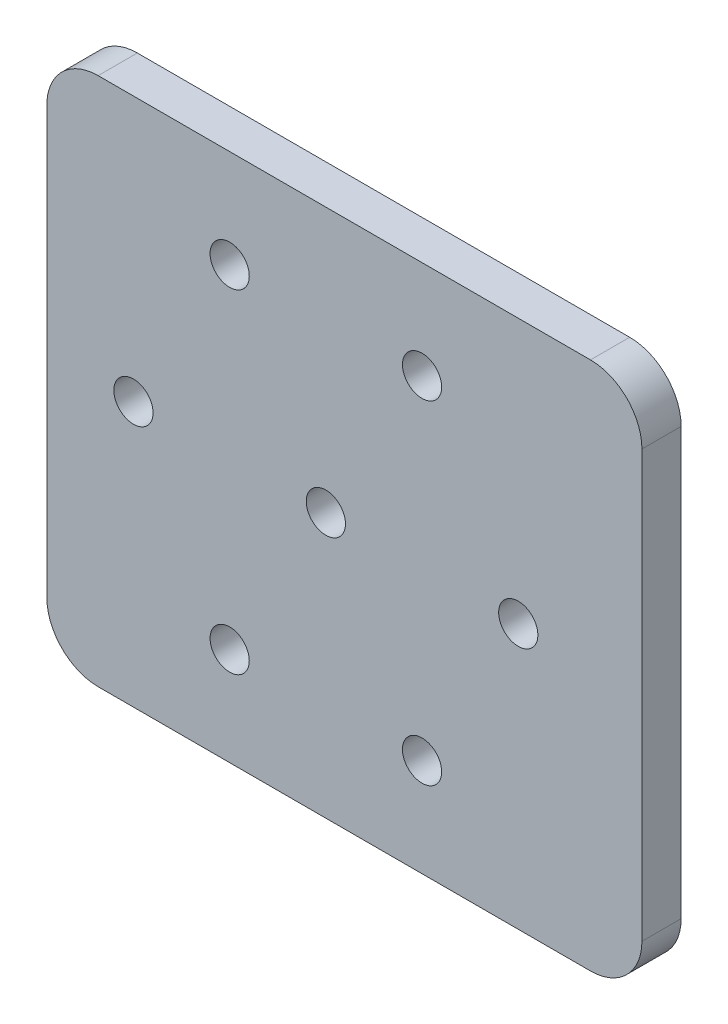
ISO-10303-21;
HEADER;
FILE_DESCRIPTION(('STEP AP214'),'2;1');
FILE_NAME('part.step','',(''),(''),'','','');
FILE_SCHEMA(('AUTOMOTIVE_DESIGN { 1 0 10303 214 1 1 1 1 }'));
ENDSEC;
DATA;
#1=APPLICATION_CONTEXT('core data for automotive mechanical design processes');
#2=APPLICATION_PROTOCOL_DEFINITION('international standard','automotive_design',2000,#1);
#3=PRODUCT_CONTEXT('',#1,'mechanical');
#4=PRODUCT('Part','Part','',(#3));
#5=PRODUCT_RELATED_PRODUCT_CATEGORY('part','',(#4));
#6=PRODUCT_DEFINITION_FORMATION('','',#4);
#7=PRODUCT_DEFINITION_CONTEXT('part definition',#1,'design');
#8=PRODUCT_DEFINITION('design','',#6,#7);
#9=PRODUCT_DEFINITION_SHAPE('','',#8);
#10=(LENGTH_UNIT() NAMED_UNIT(*) SI_UNIT(.MILLI.,.METRE.));
#11=(NAMED_UNIT(*) PLANE_ANGLE_UNIT() SI_UNIT($,.RADIAN.));
#12=(NAMED_UNIT(*) SI_UNIT($,.STERADIAN.) SOLID_ANGLE_UNIT());
#13=UNCERTAINTY_MEASURE_WITH_UNIT(LENGTH_MEASURE(1.E-05),#10,'distance_accuracy_value','');
#14=(GEOMETRIC_REPRESENTATION_CONTEXT(3) GLOBAL_UNCERTAINTY_ASSIGNED_CONTEXT((#13)) GLOBAL_UNIT_ASSIGNED_CONTEXT((#10,
#11,#12)) REPRESENTATION_CONTEXT('',''));
#15=CARTESIAN_POINT('',(0.,0.,0.));
#16=DIRECTION('',(0.,0.,1.));
#17=DIRECTION('',(1.,0.,0.));
#18=AXIS2_PLACEMENT_3D('',#15,#16,#17);
#19=CARTESIAN_POINT('',(-196.85,171.45,25.4));
#20=DIRECTION('',(0.,-1.,0.));
#21=DIRECTION('',(0.,0.,-1.));
#22=AXIS2_PLACEMENT_3D('',#19,#20,#21);
#23=PLANE('',#22);
#24=DIRECTION('',(0.,0.,1.));
#25=VECTOR('',#24,1.);
#26=CARTESIAN_POINT('',(-122.137381725075,171.45,0.));
#27=LINE('',#26,#25);
#28=CARTESIAN_POINT('',(-122.137381725075,171.45,0.));
#29=VERTEX_POINT('',#28);
#30=CARTESIAN_POINT('',(-122.137381725075,171.45,25.4));
#31=VERTEX_POINT('',#30);
#32=EDGE_CURVE('E127',#29,#31,#27,.T.);
#33=ORIENTED_EDGE('',*,*,#32,.T.);
#34=DIRECTION('',(-1.,0.,0.));
#35=VECTOR('',#34,1.);
#36=CARTESIAN_POINT('',(-196.85,171.45,25.4));
#37=LINE('',#36,#35);
#38=CARTESIAN_POINT('',(196.85,171.45,25.4));
#39=VERTEX_POINT('',#38);
#40=EDGE_CURVE('E135',#39,#31,#37,.T.);
#41=ORIENTED_EDGE('',*,*,#40,.F.);
#42=DIRECTION('',(0.,0.,-1.));
#43=VECTOR('',#42,1.);
#44=CARTESIAN_POINT('',(196.85,171.45,25.4));
#45=LINE('',#44,#43);
#46=CARTESIAN_POINT('',(196.85,171.45,0.));
#47=VERTEX_POINT('',#46);
#48=EDGE_CURVE('E143',#39,#47,#45,.T.);
#49=ORIENTED_EDGE('',*,*,#48,.T.);
#50=DIRECTION('',(-1.,0.,0.));
#51=VECTOR('',#50,1.);
#52=CARTESIAN_POINT('',(-196.85,171.45,0.));
#53=LINE('',#52,#51);
#54=EDGE_CURVE('E140',#47,#29,#53,.T.);
#55=ORIENTED_EDGE('',*,*,#54,.T.);
#56=EDGE_LOOP('',(#33,#41,#49,#55));
#57=FACE_BOUND('',#56,.T.);
#58=ADVANCED_FACE('F35',(#57),#23,.F.);
#59=CARTESIAN_POINT('',(-196.85,-171.45,25.4));
#60=DIRECTION('',(0.,1.,0.));
#61=DIRECTION('',(0.,0.,1.));
#62=AXIS2_PLACEMENT_3D('',#59,#60,#61);
#63=PLANE('',#62);
#64=DIRECTION('',(1.,0.,0.));
#65=VECTOR('',#64,1.);
#66=CARTESIAN_POINT('',(-196.85,-171.45,25.4));
#67=LINE('',#66,#65);
#68=CARTESIAN_POINT('',(-122.025168102681,-171.45,25.4));
#69=VERTEX_POINT('',#68);
#70=CARTESIAN_POINT('',(196.85,-171.45,25.4));
#71=VERTEX_POINT('',#70);
#72=EDGE_CURVE('E87',#69,#71,#67,.T.);
#73=ORIENTED_EDGE('',*,*,#72,.F.);
#74=DIRECTION('',(0.,0.,1.));
#75=VECTOR('',#74,1.);
#76=CARTESIAN_POINT('',(-122.025168102681,-171.45,0.));
#77=LINE('',#76,#75);
#78=CARTESIAN_POINT('',(-122.025168102681,-171.45,0.));
#79=VERTEX_POINT('',#78);
#80=EDGE_CURVE('E113',#79,#69,#77,.T.);
#81=ORIENTED_EDGE('',*,*,#80,.F.);
#82=DIRECTION('',(1.,0.,0.));
#83=VECTOR('',#82,1.);
#84=CARTESIAN_POINT('',(-196.85,-171.45,0.));
#85=LINE('',#84,#83);
#86=CARTESIAN_POINT('',(196.85,-171.45,0.));
#87=VERTEX_POINT('',#86);
#88=EDGE_CURVE('E120',#79,#87,#85,.T.);
#89=ORIENTED_EDGE('',*,*,#88,.T.);
#90=DIRECTION('',(0.,0.,-1.));
#91=VECTOR('',#90,1.);
#92=CARTESIAN_POINT('',(196.85,-171.45,25.4));
#93=LINE('',#92,#91);
#94=EDGE_CURVE('E11',#71,#87,#93,.T.);
#95=ORIENTED_EDGE('',*,*,#94,.F.);
#96=EDGE_LOOP('',(#73,#81,#89,#95));
#97=FACE_BOUND('',#96,.T.);
#98=ADVANCED_FACE('F37',(#97),#63,.F.);
#99=CARTESIAN_POINT('',(196.85,-138.1125,25.4));
#100=DIRECTION('',(0.,0.,-1.));
#101=DIRECTION('',(-1.,0.,0.));
#102=AXIS2_PLACEMENT_3D('',#99,#100,#101);
#103=CYLINDRICAL_SURFACE('',#102,33.3375);
#104=CARTESIAN_POINT('',(196.85,-138.1125,0.));
#105=DIRECTION('',(0.,0.,1.));
#106=DIRECTION('',(1.,0.,0.));
#107=AXIS2_PLACEMENT_3D('',#104,#105,#106);
#108=CIRCLE('',#107,33.3375);
#109=CARTESIAN_POINT('',(230.1875,-138.1125,0.));
#110=VERTEX_POINT('',#109);
#111=EDGE_CURVE('E126',#87,#110,#108,.T.);
#112=ORIENTED_EDGE('',*,*,#111,.T.);
#113=DIRECTION('',(0.,0.,-1.));
#114=VECTOR('',#113,1.);
#115=CARTESIAN_POINT('',(230.1875,-138.1125,25.4));
#116=LINE('',#115,#114);
#117=CARTESIAN_POINT('',(230.1875,-138.1125,25.4));
#118=VERTEX_POINT('',#117);
#119=EDGE_CURVE('E43',#118,#110,#116,.T.);
#120=ORIENTED_EDGE('',*,*,#119,.F.);
#121=CARTESIAN_POINT('',(196.85,-138.1125,25.4));
#122=DIRECTION('',(0.,0.,1.));
#123=DIRECTION('',(1.,0.,0.));
#124=AXIS2_PLACEMENT_3D('',#121,#122,#123);
#125=CIRCLE('',#124,33.3375);
#126=EDGE_CURVE('E161',#71,#118,#125,.T.);
#127=ORIENTED_EDGE('',*,*,#126,.F.);
#128=ORIENTED_EDGE('',*,*,#94,.T.);
#129=EDGE_LOOP('',(#112,#120,#127,#128));
#130=FACE_BOUND('',#129,.T.);
#131=ADVANCED_FACE('F255',(#130),#103,.T.);
#132=CARTESIAN_POINT('',(230.1875,-138.1125,25.4));
#133=DIRECTION('',(-1.,0.,0.));
#134=DIRECTION('',(0.,0.,1.));
#135=AXIS2_PLACEMENT_3D('',#132,#133,#134);
#136=PLANE('',#135);
#137=DIRECTION('',(0.,1.,0.));
#138=VECTOR('',#137,1.);
#139=CARTESIAN_POINT('',(230.1875,-138.1125,0.));
#140=LINE('',#139,#138);
#141=CARTESIAN_POINT('',(230.1875,138.1125,0.));
#142=VERTEX_POINT('',#141);
#143=EDGE_CURVE('E129',#110,#142,#140,.T.);
#144=ORIENTED_EDGE('',*,*,#143,.T.);
#145=DIRECTION('',(0.,0.,-1.));
#146=VECTOR('',#145,1.);
#147=CARTESIAN_POINT('',(230.1875,138.1125,25.4));
#148=LINE('',#147,#146);
#149=CARTESIAN_POINT('',(230.1875,138.1125,25.4));
#150=VERTEX_POINT('',#149);
#151=EDGE_CURVE('E145',#150,#142,#148,.T.);
#152=ORIENTED_EDGE('',*,*,#151,.F.);
#153=DIRECTION('',(0.,1.,0.));
#154=VECTOR('',#153,1.);
#155=CARTESIAN_POINT('',(230.1875,-138.1125,25.4));
#156=LINE('',#155,#154);
#157=EDGE_CURVE('E152',#118,#150,#156,.T.);
#158=ORIENTED_EDGE('',*,*,#157,.F.);
#159=ORIENTED_EDGE('',*,*,#119,.T.);
#160=EDGE_LOOP('',(#144,#152,#158,#159));
#161=FACE_BOUND('',#160,.T.);
#162=ADVANCED_FACE('F150',(#161),#136,.F.);
#163=CARTESIAN_POINT('',(196.85,138.1125,25.4));
#164=DIRECTION('',(0.,0.,-1.));
#165=DIRECTION('',(-1.,0.,0.));
#166=AXIS2_PLACEMENT_3D('',#163,#164,#165);
#167=CYLINDRICAL_SURFACE('',#166,33.3375);
#168=CARTESIAN_POINT('',(196.85,138.1125,0.));
#169=DIRECTION('',(0.,0.,1.));
#170=DIRECTION('',(1.,0.,0.));
#171=AXIS2_PLACEMENT_3D('',#168,#169,#170);
#172=CIRCLE('',#171,33.3375);
#173=EDGE_CURVE('E80',#142,#47,#172,.T.);
#174=ORIENTED_EDGE('',*,*,#173,.T.);
#175=ORIENTED_EDGE('',*,*,#48,.F.);
#176=CARTESIAN_POINT('',(196.85,138.1125,25.4));
#177=DIRECTION('',(0.,0.,1.));
#178=DIRECTION('',(1.,0.,0.));
#179=AXIS2_PLACEMENT_3D('',#176,#177,#178);
#180=CIRCLE('',#179,33.3375);
#181=EDGE_CURVE('E59',#150,#39,#180,.T.);
#182=ORIENTED_EDGE('',*,*,#181,.F.);
#183=ORIENTED_EDGE('',*,*,#151,.T.);
#184=EDGE_LOOP('',(#174,#175,#182,#183));
#185=FACE_BOUND('',#184,.T.);
#186=ADVANCED_FACE('F160',(#185),#167,.T.);
#187=CARTESIAN_POINT('',(-196.85,-138.1125,25.4));
#188=DIRECTION('',(0.,0.,1.));
#189=DIRECTION('',(1.,0.,0.));
#190=AXIS2_PLACEMENT_3D('',#187,#188,#189);
#191=PLANE('',#190);
#192=CARTESIAN_POINT('',(-36.9249615590201,107.95,25.4));
#193=DIRECTION('',(0.,0.,1.));
#194=DIRECTION('',(1.,0.,0.));
#195=AXIS2_PLACEMENT_3D('',#192,#193,#194);
#196=CIRCLE('',#195,12.7);
#197=CARTESIAN_POINT('',(-24.2249615590201,107.95,25.4));
#198=VERTEX_POINT('',#197);
#199=EDGE_CURVE('E215',#198,#198,#196,.T.);
#200=ORIENTED_EDGE('',*,*,#199,.F.);
#201=EDGE_LOOP('',(#200));
#202=FACE_BOUND('',#201,.T.);
#203=CARTESIAN_POINT('',(87.7249615590201,107.95,25.4));
#204=DIRECTION('',(0.,0.,1.));
#205=DIRECTION('',(1.,0.,0.));
#206=AXIS2_PLACEMENT_3D('',#203,#204,#205);
#207=CIRCLE('',#206,12.7);
#208=CARTESIAN_POINT('',(100.42496155902,107.95,25.4));
#209=VERTEX_POINT('',#208);
#210=EDGE_CURVE('E209',#209,#209,#207,.T.);
#211=ORIENTED_EDGE('',*,*,#210,.F.);
#212=EDGE_LOOP('',(#211));
#213=FACE_BOUND('',#212,.T.);
#214=CARTESIAN_POINT('',(150.04992311804,0.,25.4));
#215=DIRECTION('',(0.,0.,1.));
#216=DIRECTION('',(1.,0.,0.));
#217=AXIS2_PLACEMENT_3D('',#214,#215,#216);
#218=CIRCLE('',#217,12.7);
#219=CARTESIAN_POINT('',(162.74992311804,0.,25.4));
#220=VERTEX_POINT('',#219);
#221=EDGE_CURVE('E203',#220,#220,#218,.T.);
#222=ORIENTED_EDGE('',*,*,#221,.F.);
#223=EDGE_LOOP('',(#222));
#224=FACE_BOUND('',#223,.T.);
#225=CARTESIAN_POINT('',(87.7249615590201,-107.95,25.4));
#226=DIRECTION('',(0.,0.,1.));
#227=DIRECTION('',(1.,0.,0.));
#228=AXIS2_PLACEMENT_3D('',#225,#226,#227);
#229=CIRCLE('',#228,12.7);
#230=CARTESIAN_POINT('',(100.42496155902,-107.95,25.4));
#231=VERTEX_POINT('',#230);
#232=EDGE_CURVE('E197',#231,#231,#229,.T.);
#233=ORIENTED_EDGE('',*,*,#232,.F.);
#234=EDGE_LOOP('',(#233));
#235=FACE_BOUND('',#234,.T.);
#236=CARTESIAN_POINT('',(-36.9249615590201,-107.95,25.4));
#237=DIRECTION('',(0.,0.,1.));
#238=DIRECTION('',(1.,0.,0.));
#239=AXIS2_PLACEMENT_3D('',#236,#237,#238);
#240=CIRCLE('',#239,12.7);
#241=CARTESIAN_POINT('',(-24.2249615590201,-107.95,25.4));
#242=VERTEX_POINT('',#241);
#243=EDGE_CURVE('E191',#242,#242,#240,.T.);
#244=ORIENTED_EDGE('',*,*,#243,.F.);
#245=EDGE_LOOP('',(#244));
#246=FACE_BOUND('',#245,.T.);
#247=CARTESIAN_POINT('',(-99.2499231180402,0.,25.4));
#248=DIRECTION('',(0.,0.,1.));
#249=DIRECTION('',(1.,0.,0.));
#250=AXIS2_PLACEMENT_3D('',#247,#248,#249);
#251=CIRCLE('',#250,12.7);
#252=CARTESIAN_POINT('',(-86.5499231180402,0.,25.4));
#253=VERTEX_POINT('',#252);
#254=EDGE_CURVE('E185',#253,#253,#251,.T.);
#255=ORIENTED_EDGE('',*,*,#254,.F.);
#256=EDGE_LOOP('',(#255));
#257=FACE_BOUND('',#256,.T.);
#258=CARTESIAN_POINT('',(25.4,0.,25.4));
#259=DIRECTION('',(0.,0.,1.));
#260=DIRECTION('',(1.,0.,0.));
#261=AXIS2_PLACEMENT_3D('',#258,#259,#260);
#262=CIRCLE('',#261,12.7);
#263=CARTESIAN_POINT('',(38.1,0.,25.4));
#264=VERTEX_POINT('',#263);
#265=EDGE_CURVE('E179',#264,#264,#262,.T.);
#266=ORIENTED_EDGE('',*,*,#265,.F.);
#267=EDGE_LOOP('',(#266));
#268=FACE_BOUND('',#267,.T.);
#269=CARTESIAN_POINT('',(-122.137381725075,138.176,25.4));
#270=DIRECTION('',(0.,0.,-1.));
#271=DIRECTION('',(1.,0.,0.));
#272=AXIS2_PLACEMENT_3D('',#269,#270,#271);
#273=CIRCLE('',#272,33.274);
#274=CARTESIAN_POINT('',(-155.362668102681,139.975839194492,25.4));
#275=VERTEX_POINT('',#274);
#276=EDGE_CURVE('E117',#275,#31,#273,.T.);
#277=ORIENTED_EDGE('',*,*,#276,.F.);
#278=DIRECTION('',(0.,1.,0.));
#279=VECTOR('',#278,1.);
#280=CARTESIAN_POINT('',(-155.362668102681,139.975839194492,25.4));
#281=LINE('',#280,#279);
#282=CARTESIAN_POINT('',(-155.362668102681,-138.1125,25.4));
#283=VERTEX_POINT('',#282);
#284=EDGE_CURVE('E169',#283,#275,#281,.T.);
#285=ORIENTED_EDGE('',*,*,#284,.F.);
#286=CARTESIAN_POINT('',(-122.025168102681,-138.1125,25.4));
#287=DIRECTION('',(0.,0.,-1.));
#288=DIRECTION('',(1.,0.,0.));
#289=AXIS2_PLACEMENT_3D('',#286,#287,#288);
#290=CIRCLE('',#289,33.3375);
#291=EDGE_CURVE('E172',#69,#283,#290,.T.);
#292=ORIENTED_EDGE('',*,*,#291,.F.);
#293=ORIENTED_EDGE('',*,*,#72,.T.);
#294=ORIENTED_EDGE('',*,*,#126,.T.);
#295=ORIENTED_EDGE('',*,*,#157,.T.);
#296=ORIENTED_EDGE('',*,*,#181,.T.);
#297=ORIENTED_EDGE('',*,*,#40,.T.);
#298=EDGE_LOOP('',(#277,#285,#292,#293,#294,#295,#296,#297));
#299=FACE_BOUND('',#298,.T.);
#300=ADVANCED_FACE('F221',(#202,#213,#224,#235,#246,#257,#268,#299),#191,.T.);
#301=CARTESIAN_POINT('',(-196.85,-138.1125,0.));
#302=DIRECTION('',(0.,0.,1.));
#303=DIRECTION('',(1.,0.,0.));
#304=AXIS2_PLACEMENT_3D('',#301,#302,#303);
#305=PLANE('',#304);
#306=CARTESIAN_POINT('',(-36.9249615590201,107.95,0.));
#307=DIRECTION('',(0.,0.,1.));
#308=DIRECTION('',(1.,0.,0.));
#309=AXIS2_PLACEMENT_3D('',#306,#307,#308);
#310=CIRCLE('',#309,12.7);
#311=CARTESIAN_POINT('',(-24.2249615590201,107.95,0.));
#312=VERTEX_POINT('',#311);
#313=EDGE_CURVE('E212',#312,#312,#310,.T.);
#314=ORIENTED_EDGE('',*,*,#313,.T.);
#315=EDGE_LOOP('',(#314));
#316=FACE_BOUND('',#315,.T.);
#317=CARTESIAN_POINT('',(87.7249615590201,107.95,0.));
#318=DIRECTION('',(0.,0.,1.));
#319=DIRECTION('',(1.,0.,0.));
#320=AXIS2_PLACEMENT_3D('',#317,#318,#319);
#321=CIRCLE('',#320,12.7);
#322=CARTESIAN_POINT('',(100.42496155902,107.95,0.));
#323=VERTEX_POINT('',#322);
#324=EDGE_CURVE('E206',#323,#323,#321,.T.);
#325=ORIENTED_EDGE('',*,*,#324,.T.);
#326=EDGE_LOOP('',(#325));
#327=FACE_BOUND('',#326,.T.);
#328=CARTESIAN_POINT('',(150.04992311804,0.,0.));
#329=DIRECTION('',(0.,0.,1.));
#330=DIRECTION('',(1.,0.,0.));
#331=AXIS2_PLACEMENT_3D('',#328,#329,#330);
#332=CIRCLE('',#331,12.7);
#333=CARTESIAN_POINT('',(162.74992311804,0.,0.));
#334=VERTEX_POINT('',#333);
#335=EDGE_CURVE('E200',#334,#334,#332,.T.);
#336=ORIENTED_EDGE('',*,*,#335,.T.);
#337=EDGE_LOOP('',(#336));
#338=FACE_BOUND('',#337,.T.);
#339=CARTESIAN_POINT('',(87.7249615590201,-107.95,0.));
#340=DIRECTION('',(0.,0.,1.));
#341=DIRECTION('',(1.,0.,0.));
#342=AXIS2_PLACEMENT_3D('',#339,#340,#341);
#343=CIRCLE('',#342,12.7);
#344=CARTESIAN_POINT('',(100.42496155902,-107.95,0.));
#345=VERTEX_POINT('',#344);
#346=EDGE_CURVE('E194',#345,#345,#343,.T.);
#347=ORIENTED_EDGE('',*,*,#346,.T.);
#348=EDGE_LOOP('',(#347));
#349=FACE_BOUND('',#348,.T.);
#350=CARTESIAN_POINT('',(-36.9249615590201,-107.95,0.));
#351=DIRECTION('',(0.,0.,1.));
#352=DIRECTION('',(1.,0.,0.));
#353=AXIS2_PLACEMENT_3D('',#350,#351,#352);
#354=CIRCLE('',#353,12.7);
#355=CARTESIAN_POINT('',(-24.2249615590201,-107.95,0.));
#356=VERTEX_POINT('',#355);
#357=EDGE_CURVE('E188',#356,#356,#354,.T.);
#358=ORIENTED_EDGE('',*,*,#357,.T.);
#359=EDGE_LOOP('',(#358));
#360=FACE_BOUND('',#359,.T.);
#361=CARTESIAN_POINT('',(-99.2499231180402,0.,0.));
#362=DIRECTION('',(0.,0.,1.));
#363=DIRECTION('',(1.,0.,0.));
#364=AXIS2_PLACEMENT_3D('',#361,#362,#363);
#365=CIRCLE('',#364,12.7);
#366=CARTESIAN_POINT('',(-86.5499231180402,0.,0.));
#367=VERTEX_POINT('',#366);
#368=EDGE_CURVE('E182',#367,#367,#365,.T.);
#369=ORIENTED_EDGE('',*,*,#368,.T.);
#370=EDGE_LOOP('',(#369));
#371=FACE_BOUND('',#370,.T.);
#372=CARTESIAN_POINT('',(25.4,0.,0.));
#373=DIRECTION('',(0.,0.,1.));
#374=DIRECTION('',(1.,0.,0.));
#375=AXIS2_PLACEMENT_3D('',#372,#373,#374);
#376=CIRCLE('',#375,12.7);
#377=CARTESIAN_POINT('',(38.1,0.,0.));
#378=VERTEX_POINT('',#377);
#379=EDGE_CURVE('E174',#378,#378,#376,.T.);
#380=ORIENTED_EDGE('',*,*,#379,.T.);
#381=EDGE_LOOP('',(#380));
#382=FACE_BOUND('',#381,.T.);
#383=DIRECTION('',(0.,1.,0.));
#384=VECTOR('',#383,1.);
#385=CARTESIAN_POINT('',(-155.362668102681,139.975839194492,0.));
#386=LINE('',#385,#384);
#387=CARTESIAN_POINT('',(-155.362668102681,-138.1125,0.));
#388=VERTEX_POINT('',#387);
#389=CARTESIAN_POINT('',(-155.362668102681,139.975839194492,0.));
#390=VERTEX_POINT('',#389);
#391=EDGE_CURVE('E50',#388,#390,#386,.T.);
#392=ORIENTED_EDGE('',*,*,#391,.T.);
#393=CARTESIAN_POINT('',(-122.137381725075,138.176,0.));
#394=DIRECTION('',(0.,0.,-1.));
#395=DIRECTION('',(1.,0.,0.));
#396=AXIS2_PLACEMENT_3D('',#393,#394,#395);
#397=CIRCLE('',#396,33.274);
#398=EDGE_CURVE('E121',#390,#29,#397,.T.);
#399=ORIENTED_EDGE('',*,*,#398,.T.);
#400=ORIENTED_EDGE('',*,*,#54,.F.);
#401=ORIENTED_EDGE('',*,*,#173,.F.);
#402=ORIENTED_EDGE('',*,*,#143,.F.);
#403=ORIENTED_EDGE('',*,*,#111,.F.);
#404=ORIENTED_EDGE('',*,*,#88,.F.);
#405=CARTESIAN_POINT('',(-122.025168102681,-138.1125,0.));
#406=DIRECTION('',(0.,0.,-1.));
#407=DIRECTION('',(1.,0.,0.));
#408=AXIS2_PLACEMENT_3D('',#405,#406,#407);
#409=CIRCLE('',#408,33.3375);
#410=EDGE_CURVE('E109',#79,#388,#409,.T.);
#411=ORIENTED_EDGE('',*,*,#410,.T.);
#412=EDGE_LOOP('',(#392,#399,#400,#401,#402,#403,#404,#411));
#413=FACE_BOUND('',#412,.T.);
#414=ADVANCED_FACE('F124',(#316,#327,#338,#349,#360,#371,#382,#413),#305,.F.);
#415=CARTESIAN_POINT('',(-122.137381725075,138.176,0.));
#416=DIRECTION('',(0.,0.,1.));
#417=DIRECTION('',(1.,0.,0.));
#418=AXIS2_PLACEMENT_3D('',#415,#416,#417);
#419=CYLINDRICAL_SURFACE('',#418,33.274);
#420=ORIENTED_EDGE('',*,*,#276,.T.);
#421=ORIENTED_EDGE('',*,*,#32,.F.);
#422=ORIENTED_EDGE('',*,*,#398,.F.);
#423=DIRECTION('',(0.,0.,1.));
#424=VECTOR('',#423,1.);
#425=CARTESIAN_POINT('',(-155.362668102681,139.975839194492,0.));
#426=LINE('',#425,#424);
#427=EDGE_CURVE('E132',#390,#275,#426,.T.);
#428=ORIENTED_EDGE('',*,*,#427,.T.);
#429=EDGE_LOOP('',(#420,#421,#422,#428));
#430=FACE_BOUND('',#429,.T.);
#431=ADVANCED_FACE('F239',(#430),#419,.T.);
#432=CARTESIAN_POINT('',(-155.362668102681,139.975839194492,0.));
#433=DIRECTION('',(1.,0.,0.));
#434=DIRECTION('',(0.,0.,-1.));
#435=AXIS2_PLACEMENT_3D('',#432,#433,#434);
#436=PLANE('',#435);
#437=ORIENTED_EDGE('',*,*,#284,.T.);
#438=ORIENTED_EDGE('',*,*,#427,.F.);
#439=ORIENTED_EDGE('',*,*,#391,.F.);
#440=DIRECTION('',(0.,0.,1.));
#441=VECTOR('',#440,1.);
#442=CARTESIAN_POINT('',(-155.362668102681,-138.1125,0.));
#443=LINE('',#442,#441);
#444=EDGE_CURVE('E114',#388,#283,#443,.T.);
#445=ORIENTED_EDGE('',*,*,#444,.T.);
#446=EDGE_LOOP('',(#437,#438,#439,#445));
#447=FACE_BOUND('',#446,.T.);
#448=ADVANCED_FACE('F240',(#447),#436,.F.);
#449=CARTESIAN_POINT('',(-122.025168102681,-138.1125,0.));
#450=DIRECTION('',(0.,0.,1.));
#451=DIRECTION('',(1.,0.,0.));
#452=AXIS2_PLACEMENT_3D('',#449,#450,#451);
#453=CYLINDRICAL_SURFACE('',#452,33.3375);
#454=ORIENTED_EDGE('',*,*,#291,.T.);
#455=ORIENTED_EDGE('',*,*,#444,.F.);
#456=ORIENTED_EDGE('',*,*,#410,.F.);
#457=ORIENTED_EDGE('',*,*,#80,.T.);
#458=EDGE_LOOP('',(#454,#455,#456,#457));
#459=FACE_BOUND('',#458,.T.);
#460=ADVANCED_FACE('F112',(#459),#453,.T.);
#461=CARTESIAN_POINT('',(25.4,0.,25.4));
#462=DIRECTION('',(0.,0.,1.));
#463=DIRECTION('',(1.,0.,0.));
#464=AXIS2_PLACEMENT_3D('',#461,#462,#463);
#465=CYLINDRICAL_SURFACE('',#464,12.7);
#466=ORIENTED_EDGE('',*,*,#379,.F.);
#467=EDGE_LOOP('',(#466));
#468=FACE_BOUND('',#467,.T.);
#469=ORIENTED_EDGE('',*,*,#265,.T.);
#470=EDGE_LOOP('',(#469));
#471=FACE_BOUND('',#470,.T.);
#472=ADVANCED_FACE('F247',(#468,#471),#465,.F.);
#473=CARTESIAN_POINT('',(-99.2499231180402,0.,25.4));
#474=DIRECTION('',(0.,0.,1.));
#475=DIRECTION('',(1.,0.,0.));
#476=AXIS2_PLACEMENT_3D('',#473,#474,#475);
#477=CYLINDRICAL_SURFACE('',#476,12.7);
#478=ORIENTED_EDGE('',*,*,#368,.F.);
#479=EDGE_LOOP('',(#478));
#480=FACE_BOUND('',#479,.T.);
#481=ORIENTED_EDGE('',*,*,#254,.T.);
#482=EDGE_LOOP('',(#481));
#483=FACE_BOUND('',#482,.T.);
#484=ADVANCED_FACE('F308',(#480,#483),#477,.F.);
#485=CARTESIAN_POINT('',(-36.9249615590201,-107.95,25.4));
#486=DIRECTION('',(0.,0.,1.));
#487=DIRECTION('',(1.,0.,0.));
#488=AXIS2_PLACEMENT_3D('',#485,#486,#487);
#489=CYLINDRICAL_SURFACE('',#488,12.7);
#490=ORIENTED_EDGE('',*,*,#357,.F.);
#491=EDGE_LOOP('',(#490));
#492=FACE_BOUND('',#491,.T.);
#493=ORIENTED_EDGE('',*,*,#243,.T.);
#494=EDGE_LOOP('',(#493));
#495=FACE_BOUND('',#494,.T.);
#496=ADVANCED_FACE('F318',(#492,#495),#489,.F.);
#497=CARTESIAN_POINT('',(87.7249615590201,-107.95,25.4));
#498=DIRECTION('',(0.,0.,1.));
#499=DIRECTION('',(1.,0.,0.));
#500=AXIS2_PLACEMENT_3D('',#497,#498,#499);
#501=CYLINDRICAL_SURFACE('',#500,12.7);
#502=ORIENTED_EDGE('',*,*,#346,.F.);
#503=EDGE_LOOP('',(#502));
#504=FACE_BOUND('',#503,.T.);
#505=ORIENTED_EDGE('',*,*,#232,.T.);
#506=EDGE_LOOP('',(#505));
#507=FACE_BOUND('',#506,.T.);
#508=ADVANCED_FACE('F328',(#504,#507),#501,.F.);
#509=CARTESIAN_POINT('',(150.04992311804,0.,25.4));
#510=DIRECTION('',(0.,0.,1.));
#511=DIRECTION('',(1.,0.,0.));
#512=AXIS2_PLACEMENT_3D('',#509,#510,#511);
#513=CYLINDRICAL_SURFACE('',#512,12.7);
#514=ORIENTED_EDGE('',*,*,#335,.F.);
#515=EDGE_LOOP('',(#514));
#516=FACE_BOUND('',#515,.T.);
#517=ORIENTED_EDGE('',*,*,#221,.T.);
#518=EDGE_LOOP('',(#517));
#519=FACE_BOUND('',#518,.T.);
#520=ADVANCED_FACE('F338',(#516,#519),#513,.F.);
#521=CARTESIAN_POINT('',(87.7249615590201,107.95,25.4));
#522=DIRECTION('',(0.,0.,1.));
#523=DIRECTION('',(1.,0.,0.));
#524=AXIS2_PLACEMENT_3D('',#521,#522,#523);
#525=CYLINDRICAL_SURFACE('',#524,12.7);
#526=ORIENTED_EDGE('',*,*,#324,.F.);
#527=EDGE_LOOP('',(#526));
#528=FACE_BOUND('',#527,.T.);
#529=ORIENTED_EDGE('',*,*,#210,.T.);
#530=EDGE_LOOP('',(#529));
#531=FACE_BOUND('',#530,.T.);
#532=ADVANCED_FACE('F348',(#528,#531),#525,.F.);
#533=CARTESIAN_POINT('',(-36.9249615590201,107.95,25.4));
#534=DIRECTION('',(0.,0.,1.));
#535=DIRECTION('',(1.,0.,0.));
#536=AXIS2_PLACEMENT_3D('',#533,#534,#535);
#537=CYLINDRICAL_SURFACE('',#536,12.7);
#538=ORIENTED_EDGE('',*,*,#313,.F.);
#539=EDGE_LOOP('',(#538));
#540=FACE_BOUND('',#539,.T.);
#541=ORIENTED_EDGE('',*,*,#199,.T.);
#542=EDGE_LOOP('',(#541));
#543=FACE_BOUND('',#542,.T.);
#544=ADVANCED_FACE('F219',(#540,#543),#537,.F.);
#545=CLOSED_SHELL('',(#58,#98,#131,#162,#186,#300,#414,#431,#448,#460,#472,#484,#496,#508,#520,
#532,#544));
#546=MANIFOLD_SOLID_BREP('B2',#545);
#547=ADVANCED_BREP_SHAPE_REPRESENTATION('',(#18,#546),#14);
#548=SHAPE_DEFINITION_REPRESENTATION(#9,#547);
ENDSEC;
END-ISO-10303-21;
